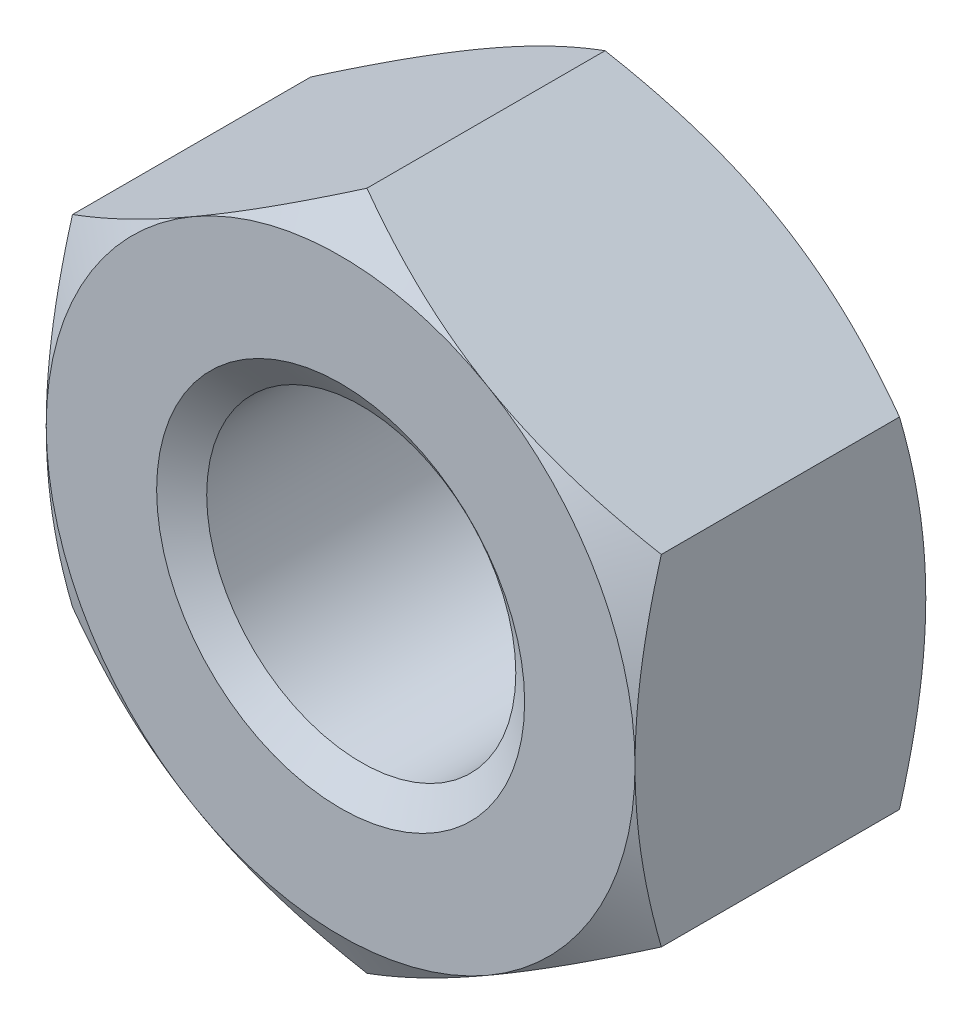
ISO-10303-21;
HEADER;
FILE_DESCRIPTION(('STEP AP214'),'2;1');
FILE_NAME('part.step','',(''),(''),'','','');
FILE_SCHEMA(('AUTOMOTIVE_DESIGN { 1 0 10303 214 1 1 1 1 }'));
ENDSEC;
DATA;
#1=APPLICATION_CONTEXT('core data for automotive mechanical design processes');
#2=APPLICATION_PROTOCOL_DEFINITION('international standard','automotive_design',2000,#1);
#3=PRODUCT_CONTEXT('',#1,'mechanical');
#4=PRODUCT('Part','Part','',(#3));
#5=PRODUCT_RELATED_PRODUCT_CATEGORY('part','',(#4));
#6=PRODUCT_DEFINITION_FORMATION('','',#4);
#7=PRODUCT_DEFINITION_CONTEXT('part definition',#1,'design');
#8=PRODUCT_DEFINITION('design','',#6,#7);
#9=PRODUCT_DEFINITION_SHAPE('','',#8);
#10=(LENGTH_UNIT() NAMED_UNIT(*) SI_UNIT(.MILLI.,.METRE.));
#11=(NAMED_UNIT(*) PLANE_ANGLE_UNIT() SI_UNIT($,.RADIAN.));
#12=(NAMED_UNIT(*) SI_UNIT($,.STERADIAN.) SOLID_ANGLE_UNIT());
#13=UNCERTAINTY_MEASURE_WITH_UNIT(LENGTH_MEASURE(1.E-05),#10,'distance_accuracy_value','');
#14=(GEOMETRIC_REPRESENTATION_CONTEXT(3) GLOBAL_UNCERTAINTY_ASSIGNED_CONTEXT((#13)) GLOBAL_UNIT_ASSIGNED_CONTEXT((#10,
#11,#12)) REPRESENTATION_CONTEXT('',''));
#15=CARTESIAN_POINT('',(0.,0.,0.));
#16=DIRECTION('',(0.,0.,1.));
#17=DIRECTION('',(1.,0.,0.));
#18=AXIS2_PLACEMENT_3D('',#15,#16,#17);
#19=CARTESIAN_POINT('',(0.,0.,-3.95));
#20=DIRECTION('',(0.,0.,1.));
#21=DIRECTION('',(1.,0.,0.));
#22=AXIS2_PLACEMENT_3D('',#19,#20,#21);
#23=CYLINDRICAL_SURFACE('',#22,2.1);
#24=CARTESIAN_POINT('',(0.,0.,-0.280083015283876));
#25=DIRECTION('',(0.,0.,1.));
#26=DIRECTION('',(1.,0.,0.));
#27=AXIS2_PLACEMENT_3D('',#24,#25,#26);
#28=CIRCLE('',#27,2.1);
#29=CARTESIAN_POINT('',(2.1,0.,-0.280083015283876));
#30=VERTEX_POINT('',#29);
#31=EDGE_CURVE('E174',#30,#30,#28,.F.);
#32=ORIENTED_EDGE('',*,*,#31,.F.);
#33=EDGE_LOOP('',(#32));
#34=FACE_BOUND('',#33,.T.);
#35=CARTESIAN_POINT('',(0.,0.,-3.64451698471612));
#36=DIRECTION('',(0.,0.,-1.));
#37=DIRECTION('',(-1.,0.,0.));
#38=AXIS2_PLACEMENT_3D('',#35,#36,#37);
#39=CIRCLE('',#38,2.1);
#40=CARTESIAN_POINT('',(-2.1,0.,-3.64451698471612));
#41=VERTEX_POINT('',#40);
#42=EDGE_CURVE('E39',#41,#41,#39,.F.);
#43=ORIENTED_EDGE('',*,*,#42,.F.);
#44=EDGE_LOOP('',(#43));
#45=FACE_BOUND('',#44,.T.);
#46=ADVANCED_FACE('F34',(#34,#45),#23,.F.);
#47=CARTESIAN_POINT('',(0.,4.61880215351703,-3.95));
#48=DIRECTION('',(0.,0.,-1.));
#49=DIRECTION('',(-1.,0.,0.));
#50=AXIS2_PLACEMENT_3D('',#47,#48,#49);
#51=PLANE('',#50);
#52=CARTESIAN_POINT('',(0.,0.,-3.95));
#53=DIRECTION('',(0.,0.,-1.));
#54=DIRECTION('',(-1.,0.,0.));
#55=AXIS2_PLACEMENT_3D('',#52,#53,#54);
#56=CIRCLE('',#55,4.);
#57=CARTESIAN_POINT('',(-4.,0.,-3.95));
#58=VERTEX_POINT('',#57);
#59=CARTESIAN_POINT('',(-2.00000000000003,-3.46410161513774,-3.95));
#60=VERTEX_POINT('',#59);
#61=EDGE_CURVE('E170',#58,#60,#56,.F.);
#62=ORIENTED_EDGE('',*,*,#61,.F.);
#63=CARTESIAN_POINT('',(-2.00000000000003,3.46410161513774,-3.95));
#64=VERTEX_POINT('',#63);
#65=EDGE_CURVE('E152',#64,#58,#56,.F.);
#66=ORIENTED_EDGE('',*,*,#65,.F.);
#67=CARTESIAN_POINT('',(2.00000000000004,3.46410161513773,-3.95));
#68=VERTEX_POINT('',#67);
#69=EDGE_CURVE('E169',#68,#64,#56,.F.);
#70=ORIENTED_EDGE('',*,*,#69,.F.);
#71=CARTESIAN_POINT('',(0.,0.,-3.95));
#72=DIRECTION('',(0.,0.,1.));
#73=DIRECTION('',(1.,0.,0.));
#74=AXIS2_PLACEMENT_3D('',#71,#72,#73);
#75=CIRCLE('',#74,4.);
#76=CARTESIAN_POINT('',(4.,0.,-3.95));
#77=VERTEX_POINT('',#76);
#78=EDGE_CURVE('E250',#77,#68,#75,.T.);
#79=ORIENTED_EDGE('',*,*,#78,.F.);
#80=CARTESIAN_POINT('',(2.00000000000003,-3.46410161513774,-3.95));
#81=VERTEX_POINT('',#80);
#82=EDGE_CURVE('E371',#81,#77,#56,.F.);
#83=ORIENTED_EDGE('',*,*,#82,.F.);
#84=EDGE_CURVE('E375',#60,#81,#56,.F.);
#85=ORIENTED_EDGE('',*,*,#84,.F.);
#86=EDGE_LOOP('',(#62,#66,#70,#79,#83,#85));
#87=FACE_BOUND('',#86,.T.);
#88=CARTESIAN_POINT('',(0.,0.,-3.95));
#89=DIRECTION('',(0.,0.,-1.));
#90=DIRECTION('',(-1.,0.,0.));
#91=AXIS2_PLACEMENT_3D('',#88,#89,#90);
#92=CIRCLE('',#91,2.5);
#93=CARTESIAN_POINT('',(-2.5,0.,-3.95));
#94=VERTEX_POINT('',#93);
#95=EDGE_CURVE('E177',#94,#94,#92,.F.);
#96=ORIENTED_EDGE('',*,*,#95,.T.);
#97=EDGE_LOOP('',(#96));
#98=FACE_BOUND('',#97,.T.);
#99=ADVANCED_FACE('F308',(#87,#98),#51,.T.);
#100=CARTESIAN_POINT('',(0.,4.61880215351703,0.));
#101=DIRECTION('',(0.,0.,-1.));
#102=DIRECTION('',(-1.,0.,0.));
#103=AXIS2_PLACEMENT_3D('',#100,#101,#102);
#104=PLANE('',#103);
#105=CARTESIAN_POINT('',(0.,0.,0.));
#106=DIRECTION('',(0.,0.,-1.));
#107=DIRECTION('',(-1.,0.,0.));
#108=AXIS2_PLACEMENT_3D('',#105,#106,#107);
#109=CIRCLE('',#108,4.);
#110=CARTESIAN_POINT('',(-4.,0.,0.));
#111=VERTEX_POINT('',#110);
#112=CARTESIAN_POINT('',(-2.00000000000003,3.46410161513774,0.));
#113=VERTEX_POINT('',#112);
#114=EDGE_CURVE('E11',#111,#113,#109,.T.);
#115=ORIENTED_EDGE('',*,*,#114,.F.);
#116=CARTESIAN_POINT('',(-2.00000000000003,-3.46410161513774,0.));
#117=VERTEX_POINT('',#116);
#118=EDGE_CURVE('E46',#117,#111,#109,.T.);
#119=ORIENTED_EDGE('',*,*,#118,.F.);
#120=CARTESIAN_POINT('',(2.00000000000003,-3.46410161513774,0.));
#121=VERTEX_POINT('',#120);
#122=EDGE_CURVE('E173',#121,#117,#109,.T.);
#123=ORIENTED_EDGE('',*,*,#122,.F.);
#124=CARTESIAN_POINT('',(4.,0.,0.));
#125=VERTEX_POINT('',#124);
#126=EDGE_CURVE('E362',#125,#121,#109,.T.);
#127=ORIENTED_EDGE('',*,*,#126,.F.);
#128=CARTESIAN_POINT('',(0.,0.,0.));
#129=DIRECTION('',(0.,0.,1.));
#130=DIRECTION('',(1.,0.,0.));
#131=AXIS2_PLACEMENT_3D('',#128,#129,#130);
#132=CIRCLE('',#131,4.);
#133=CARTESIAN_POINT('',(2.00000000000004,3.46410161513773,0.));
#134=VERTEX_POINT('',#133);
#135=EDGE_CURVE('E128',#125,#134,#132,.T.);
#136=ORIENTED_EDGE('',*,*,#135,.T.);
#137=EDGE_CURVE('E44',#113,#134,#109,.T.);
#138=ORIENTED_EDGE('',*,*,#137,.F.);
#139=EDGE_LOOP('',(#115,#119,#123,#127,#136,#138));
#140=FACE_BOUND('',#139,.T.);
#141=CARTESIAN_POINT('',(0.,0.,0.));
#142=DIRECTION('',(0.,0.,1.));
#143=DIRECTION('',(1.,0.,0.));
#144=AXIS2_PLACEMENT_3D('',#141,#142,#143);
#145=CIRCLE('',#144,2.5);
#146=CARTESIAN_POINT('',(2.5,0.,0.));
#147=VERTEX_POINT('',#146);
#148=EDGE_CURVE('E176',#147,#147,#145,.T.);
#149=ORIENTED_EDGE('',*,*,#148,.F.);
#150=EDGE_LOOP('',(#149));
#151=FACE_BOUND('',#150,.T.);
#152=ADVANCED_FACE('F255',(#140,#151),#104,.F.);
#153=CARTESIAN_POINT('',(0.,4.61880215351703,-3.95));
#154=DIRECTION('',(-0.500000000000007,0.866025403784434,0.));
#155=DIRECTION('',(-0.866025403784435,-0.500000000000007,0.));
#156=AXIS2_PLACEMENT_3D('',#153,#154,#155);
#157=PLANE('',#156);
#158=DIRECTION('',(0.,0.,1.));
#159=VECTOR('',#158,1.);
#160=CARTESIAN_POINT('',(-4.,2.30940107675848,-3.95));
#161=LINE('',#160,#159);
#162=CARTESIAN_POINT('',(-4.,2.30940107675855,-3.59273441009182));
#163=VERTEX_POINT('',#162);
#164=CARTESIAN_POINT('',(-4.,2.30940107675848,-0.357265589908163));
#165=VERTEX_POINT('',#164);
#166=EDGE_CURVE('E164',#163,#165,#161,.T.);
#167=ORIENTED_EDGE('',*,*,#166,.T.);
#168=CARTESIAN_POINT('',(-4.0002,2.30928560670464,-0.357332259074767));
#169=CARTESIAN_POINT('',(-3.82442084967677,2.41077174646168,-0.298717873648282));
#170=CARTESIAN_POINT('',(-3.64712438367362,2.51313390883498,-0.245410321462262));
#171=CARTESIAN_POINT('',(-3.2894614068243,2.7196307247981,-0.152361670746402));
#172=CARTESIAN_POINT('',(-3.10908854102985,2.82376904741903,-0.112653489029702));
#173=CARTESIAN_POINT('',(-2.75057818129721,3.03075510011794,-0.0508422152802767));
#174=CARTESIAN_POINT('',(-2.57249584706486,3.13357098372491,-0.0283277315228868));
#175=CARTESIAN_POINT('',(-2.2154932828335,3.33968651028528,-0.00145062314658061));
#176=CARTESIAN_POINT('',(-2.03657435035591,3.44298540411434,0.00293425857305748));
#177=CARTESIAN_POINT('',(-1.70225715780328,3.63600352522932,-0.00619007293997112));
#178=CARTESIAN_POINT('',(-1.54680884001294,3.72575165335065,-0.0174589539879962));
#179=CARTESIAN_POINT('',(-1.23692494436495,3.90466320392055,-0.0531739907981979));
#180=CARTESIAN_POINT('',(-1.08249043825587,3.99382600759479,-0.0776323457115395));
#181=CARTESIAN_POINT('',(-0.771967672225423,4.17310641015198,-0.138776064919299));
#182=CARTESIAN_POINT('',(-0.615918711936898,4.26320131938133,-0.175720603654875));
#183=CARTESIAN_POINT('',(-0.306148164596159,4.44204742827552,-0.259570072548043));
#184=CARTESIAN_POINT('',(-0.152422609226217,4.53080091904969,-0.306455302212758));
#185=CARTESIAN_POINT('',(0.000200000000004028,4.61891762357087,-0.357332259074788));
#186=B_SPLINE_CURVE_WITH_KNOTS('',3,(#168,#169,#170,#171,#172,#173,#174,#175,#176,#177,#178,
#179,#180,#181,#182,#183,#184,#185),.UNSPECIFIED.,.F.,.F.,(4,2,2,2,2,2,2,2,4),(0.,
0.634047835695967,1.26961969224544,1.88946157213122,2.50854226669297,3.04757825393387,
3.58711366126905,4.13861653143766,4.68903648037746),.UNSPECIFIED.);
#187=EDGE_CURVE('E133',#165,#113,#186,.T.);
#188=ORIENTED_EDGE('',*,*,#187,.T.);
#189=CARTESIAN_POINT('',(0.,4.61880215351703,-0.357265589908184));
#190=VERTEX_POINT('',#189);
#191=EDGE_CURVE('E53',#113,#190,#186,.T.);
#192=ORIENTED_EDGE('',*,*,#191,.T.);
#193=DIRECTION('',(0.,0.,1.));
#194=VECTOR('',#193,1.);
#195=CARTESIAN_POINT('',(0.,4.61880215351703,-3.95));
#196=LINE('',#195,#194);
#197=CARTESIAN_POINT('',(0.,4.61880215351703,-3.59273441009182));
#198=VERTEX_POINT('',#197);
#199=EDGE_CURVE('E149',#198,#190,#196,.T.);
#200=ORIENTED_EDGE('',*,*,#199,.F.);
#201=CARTESIAN_POINT('',(-4.0002,2.30928560670464,-3.59266774092524));
#202=CARTESIAN_POINT('',(-3.82442084967677,2.41077174646168,-3.65128212635172));
#203=CARTESIAN_POINT('',(-3.64712438367362,2.51313390883498,-3.70458967853774));
#204=CARTESIAN_POINT('',(-3.2894614068243,2.7196307247981,-3.7976383292536));
#205=CARTESIAN_POINT('',(-3.10908854102985,2.82376904741903,-3.8373465109703));
#206=CARTESIAN_POINT('',(-2.75057818129722,3.03075510011794,-3.89915778471972));
#207=CARTESIAN_POINT('',(-2.57249584706487,3.13357098372491,-3.92167226847711));
#208=CARTESIAN_POINT('',(-2.2154932828335,3.33968651028527,-3.94854937685342));
#209=CARTESIAN_POINT('',(-2.03657435035591,3.44298540411433,-3.95293425857306));
#210=CARTESIAN_POINT('',(-1.70225715780328,3.63600352522932,-3.94380992706003));
#211=CARTESIAN_POINT('',(-1.54680884001294,3.72575165335065,-3.932541046012));
#212=CARTESIAN_POINT('',(-1.23692494436495,3.90466320392055,-3.8968260092018));
#213=CARTESIAN_POINT('',(-1.08249043825587,3.99382600759479,-3.87236765428846));
#214=CARTESIAN_POINT('',(-0.771967672225424,4.17310641015198,-3.8112239350807));
#215=CARTESIAN_POINT('',(-0.615918711936899,4.26320131938133,-3.77427939634513));
#216=CARTESIAN_POINT('',(-0.306148164596159,4.44204742827552,-3.69042992745196));
#217=CARTESIAN_POINT('',(-0.152422609226218,4.53080091904968,-3.64354469778725));
#218=CARTESIAN_POINT('',(0.000200000000004024,4.61891762357087,-3.59266774092522));
#219=B_SPLINE_CURVE_WITH_KNOTS('',3,(#201,#202,#203,#204,#205,#206,#207,#208,#209,#210,#211,
#212,#213,#214,#215,#216,#217,#218),.UNSPECIFIED.,.F.,.F.,(4,2,2,2,2,2,2,2,4),(0.,
0.634047835695966,1.26961969224543,1.88946157213122,2.50854226669297,3.04757825393386,
3.58711366126905,4.13861653143766,4.68903648037746),.UNSPECIFIED.);
#220=EDGE_CURVE('E167',#64,#198,#219,.T.);
#221=ORIENTED_EDGE('',*,*,#220,.F.);
#222=EDGE_CURVE('E266',#163,#64,#219,.T.);
#223=ORIENTED_EDGE('',*,*,#222,.F.);
#224=EDGE_LOOP('',(#167,#188,#192,#200,#221,#223));
#225=FACE_BOUND('',#224,.T.);
#226=ADVANCED_FACE('F36',(#225),#157,.T.);
#227=CARTESIAN_POINT('',(4.,2.30940107675847,-3.95));
#228=DIRECTION('',(0.500000000000009,0.866025403784433,0.));
#229=DIRECTION('',(-0.866025403784433,0.500000000000009,0.));
#230=AXIS2_PLACEMENT_3D('',#227,#228,#229);
#231=PLANE('',#230);
#232=ORIENTED_EDGE('',*,*,#199,.T.);
#233=CARTESIAN_POINT('',(-0.000199999999996007,4.61891762357087,-0.357332259074788));
#234=CARTESIAN_POINT('',(0.175579150323232,4.51743148381383,-0.298717873648301));
#235=CARTESIAN_POINT('',(0.352875616326385,4.41506932144053,-0.245410321462279));
#236=CARTESIAN_POINT('',(0.710538593175711,4.20857250547741,-0.152361670746414));
#237=CARTESIAN_POINT('',(0.890911458970156,4.10443418285648,-0.112653489029713));
#238=CARTESIAN_POINT('',(1.2494218187028,3.89744813015756,-0.0508422152802838));
#239=CARTESIAN_POINT('',(1.42750415293515,3.7946322465506,-0.0283277315228919));
#240=CARTESIAN_POINT('',(1.78450671716651,3.58851671999023,-0.0014506231465821));
#241=CARTESIAN_POINT('',(1.96342564964411,3.48521782616117,0.00293425857305754));
#242=CARTESIAN_POINT('',(2.29774284219674,3.29219970504618,-0.00619007293996784));
#243=CARTESIAN_POINT('',(2.45319115998707,3.20245157692485,-0.0174589539879911));
#244=CARTESIAN_POINT('',(2.76307505563506,3.02354002635495,-0.0531739907981892));
#245=CARTESIAN_POINT('',(2.91750956174413,2.93437722268071,-0.0776323457115289));
#246=CARTESIAN_POINT('',(3.22803232777458,2.75509682012352,-0.138776064919285));
#247=CARTESIAN_POINT('',(3.3840812880631,2.66500191089418,-0.175720603654859));
#248=CARTESIAN_POINT('',(3.69385183540384,2.48615580199998,-0.259570072548024));
#249=CARTESIAN_POINT('',(3.84757739077378,2.39740231122582,-0.306455302212737));
#250=CARTESIAN_POINT('',(4.0002,2.30928560670464,-0.357332259074765));
#251=B_SPLINE_CURVE_WITH_KNOTS('',3,(#233,#234,#235,#236,#237,#238,#239,#240,#241,#242,#243,
#244,#245,#246,#247,#248,#249,#250),.UNSPECIFIED.,.F.,.F.,(4,2,2,2,2,2,2,2,4),(0.,
0.634047835695972,1.26961969224545,1.88946157213124,2.50854226669299,3.04757825393388,
3.58711366126906,4.13861653143766,4.68903648037746),.UNSPECIFIED.);
#252=EDGE_CURVE('E143',#190,#134,#251,.T.);
#253=ORIENTED_EDGE('',*,*,#252,.T.);
#254=CARTESIAN_POINT('',(4.,2.30940107675855,-0.357265589908184));
#255=VERTEX_POINT('',#254);
#256=EDGE_CURVE('E60',#134,#255,#251,.T.);
#257=ORIENTED_EDGE('',*,*,#256,.T.);
#258=DIRECTION('',(0.,0.,1.));
#259=VECTOR('',#258,1.);
#260=CARTESIAN_POINT('',(4.,2.30940107675847,-3.95));
#261=LINE('',#260,#259);
#262=CARTESIAN_POINT('',(4.,2.30940107675855,-3.59273441009182));
#263=VERTEX_POINT('',#262);
#264=EDGE_CURVE('E142',#263,#255,#261,.T.);
#265=ORIENTED_EDGE('',*,*,#264,.F.);
#266=CARTESIAN_POINT('',(-0.000199999999996007,4.61891762357087,-3.59266774092522));
#267=CARTESIAN_POINT('',(0.175579150323232,4.51743148381383,-3.6512821263517));
#268=CARTESIAN_POINT('',(0.352875616326384,4.41506932144053,-3.70458967853773));
#269=CARTESIAN_POINT('',(0.71053859317571,4.20857250547741,-3.79763832925359));
#270=CARTESIAN_POINT('',(0.890911458970154,4.10443418285648,-3.83734651097029));
#271=CARTESIAN_POINT('',(1.24942181870279,3.89744813015757,-3.89915778471972));
#272=CARTESIAN_POINT('',(1.42750415293514,3.7946322465506,-3.92167226847711));
#273=CARTESIAN_POINT('',(1.78450671716651,3.58851671999023,-3.94854937685342));
#274=CARTESIAN_POINT('',(1.9634256496441,3.48521782616117,-3.95293425857306));
#275=CARTESIAN_POINT('',(2.29774284219673,3.29219970504618,-3.94380992706003));
#276=CARTESIAN_POINT('',(2.45319115998707,3.20245157692485,-3.93254104601201));
#277=CARTESIAN_POINT('',(2.76307505563506,3.02354002635495,-3.89682600920181));
#278=CARTESIAN_POINT('',(2.91750956174413,2.93437722268071,-3.87236765428847));
#279=CARTESIAN_POINT('',(3.22803232777458,2.75509682012352,-3.81122393508072));
#280=CARTESIAN_POINT('',(3.3840812880631,2.66500191089418,-3.77427939634514));
#281=CARTESIAN_POINT('',(3.69385183540384,2.48615580199998,-3.69042992745198));
#282=CARTESIAN_POINT('',(3.84757739077378,2.39740231122582,-3.64354469778727));
#283=CARTESIAN_POINT('',(4.0002,2.30928560670464,-3.59266774092524));
#284=B_SPLINE_CURVE_WITH_KNOTS('',3,(#266,#267,#268,#269,#270,#271,#272,#273,#274,#275,#276,
#277,#278,#279,#280,#281,#282,#283),.UNSPECIFIED.,.F.,.F.,(4,2,2,2,2,2,2,2,4),(0.,
0.634047835695971,1.26961969224544,1.88946157213123,2.50854226669299,3.04757825393387,
3.58711366126905,4.13861653143766,4.68903648037746),.UNSPECIFIED.);
#285=EDGE_CURVE('E259',#68,#263,#284,.T.);
#286=ORIENTED_EDGE('',*,*,#285,.F.);
#287=EDGE_CURVE('E265',#198,#68,#284,.T.);
#288=ORIENTED_EDGE('',*,*,#287,.F.);
#289=EDGE_LOOP('',(#232,#253,#257,#265,#286,#288));
#290=FACE_BOUND('',#289,.T.);
#291=ADVANCED_FACE('F140',(#290),#231,.T.);
#292=CARTESIAN_POINT('',(4.,2.30940107675847,-3.95));
#293=DIRECTION('',(-1.,0.,0.));
#294=DIRECTION('',(0.,0.,1.));
#295=AXIS2_PLACEMENT_3D('',#292,#293,#294);
#296=PLANE('',#295);
#297=CARTESIAN_POINT('',(4.,-6.12487198995898,-1.9141068212407));
#298=CARTESIAN_POINT('',(4.,-5.94924937038682,-1.82923627076695));
#299=CARTESIAN_POINT('',(4.,-5.77321152095291,-1.74520940380745));
#300=CARTESIAN_POINT('',(4.,-5.4200808477796,-1.57932514679721));
#301=CARTESIAN_POINT('',(4.,-5.24298784779933,-1.49746813236728));
#302=CARTESIAN_POINT('',(4.,-4.88656571686339,-1.3359744630586));
#303=CARTESIAN_POINT('',(4.,-4.70722958889368,-1.25635319506308));
#304=CARTESIAN_POINT('',(4.,-4.34708334747269,-1.10053058542034));
#305=CARTESIAN_POINT('',(4.,-4.16627331143543,-1.02432906550806));
#306=CARTESIAN_POINT('',(4.,-3.80064706744983,-0.875350650394396));
#307=CARTESIAN_POINT('',(4.,-3.61580892822775,-0.802627284215878));
#308=CARTESIAN_POINT('',(4.,-3.24395246794974,-0.662876230959448));
#309=CARTESIAN_POINT('',(4.,-3.05693390695806,-0.595849177566531));
#310=CARTESIAN_POINT('',(4.,-2.68080318253775,-0.469291748430904));
#311=CARTESIAN_POINT('',(4.,-2.49169643712853,-0.409745434783858));
#312=CARTESIAN_POINT('',(4.,-2.11079454635856,-0.300083356544523));
#313=CARTESIAN_POINT('',(4.,-1.91900027185753,-0.249964609676767));
#314=CARTESIAN_POINT('',(4.,-1.53259232698204,-0.161590794954053));
#315=CARTESIAN_POINT('',(4.,-1.33797792031654,-0.123338885956549));
#316=CARTESIAN_POINT('',(4.,-0.946402725872593,-0.0612742359223493));
#317=CARTESIAN_POINT('',(4.,-0.749441936019812,-0.0374615076517035));
#318=CARTESIAN_POINT('',(4.,-0.355451989627978,-0.00638181314943817));
#319=CARTESIAN_POINT('',(4.,-0.158431311094046,0.000989900761040821));
#320=CARTESIAN_POINT('',(4.,0.235472085607436,-0.00120406637479435));
#321=CARTESIAN_POINT('',(4.,0.432354826312174,-0.0107653508153491));
#322=CARTESIAN_POINT('',(4.,0.768560635225483,-0.0408787346135881));
#323=CARTESIAN_POINT('',(4.,0.908254618381783,-0.0575092960439064));
#324=CARTESIAN_POINT('',(4.,1.18656349063493,-0.0982134103466865));
#325=CARTESIAN_POINT('',(4.,1.32517820601008,-0.12228813705844));
#326=CARTESIAN_POINT('',(4.,1.73929045452963,-0.204415070950221));
#327=CARTESIAN_POINT('',(4.,2.01284690528716,-0.272348886425141));
#328=CARTESIAN_POINT('',(4.,2.42218253014516,-0.389516359317188));
#329=CARTESIAN_POINT('',(4.,2.56009536361531,-0.431713941811619));
#330=CARTESIAN_POINT('',(4.,2.83448159101395,-0.520284580227743));
#331=CARTESIAN_POINT('',(4.,2.97095590623549,-0.566654756186892));
#332=CARTESIAN_POINT('',(4.,3.24189440516332,-0.662605699180263));
#333=CARTESIAN_POINT('',(4.,3.37636557946829,-0.712166925753476));
#334=CARTESIAN_POINT('',(4.,3.64426461152904,-0.814198353790675));
#335=CARTESIAN_POINT('',(4.,3.77769202239377,-0.866669730963341));
#336=CARTESIAN_POINT('',(4.,3.91063698986673,-0.920309006541764));
#337=B_SPLINE_CURVE_WITH_KNOTS('',3,(#297,#298,#299,#300,#301,#302,#303,#304,#305,#306,#307,
#308,#309,#310,#311,#312,#313,#314,#315,#316,#317,#318,#319,#320,#321,#322,#323,#324,#325,#326,
#327,#328,#329,#330,#331,#332,#333,#334,#335,#336),.UNSPECIFIED.,.F.,.F.,(4,2,2,2,2,2,2,2,2,2,2,
2,2,2,2,2,2,2,2,4),(0.,0.585171792532273,1.17044423059927,1.7590659464599,2.34765694284828,
2.94347400997485,3.53935727210691,4.13394864697603,4.72835161391474,5.32291267067848,
5.91747425310816,6.5082368585404,7.09884609659891,7.52068140825525,7.94258327130842,
8.78701491359829,9.21965281897688,9.65199437116295,10.0819024146297,10.5119854255246),.UNSPECIFIED.);
#338=CARTESIAN_POINT('',(4.,-2.30940107675855,-0.357265589908184));
#339=VERTEX_POINT('',#338);
#340=EDGE_CURVE('E135',#339,#125,#337,.T.);
#341=ORIENTED_EDGE('',*,*,#340,.F.);
#342=DIRECTION('',(0.,0.,1.));
#343=VECTOR('',#342,1.);
#344=CARTESIAN_POINT('',(4.,-2.30940107675855,-3.95));
#345=LINE('',#344,#343);
#346=CARTESIAN_POINT('',(4.,-2.30940107675855,-3.59273441009182));
#347=VERTEX_POINT('',#346);
#348=EDGE_CURVE('E150',#347,#339,#345,.T.);
#349=ORIENTED_EDGE('',*,*,#348,.F.);
#350=CARTESIAN_POINT('',(4.,-6.12487198995897,-2.03589317875933));
#351=CARTESIAN_POINT('',(4.,-5.94924937038682,-2.12076372923307));
#352=CARTESIAN_POINT('',(4.,-5.77321152095291,-2.20479059619258));
#353=CARTESIAN_POINT('',(4.,-5.4200808477796,-2.37067485320281));
#354=CARTESIAN_POINT('',(4.,-5.24298784779933,-2.45253186763274));
#355=CARTESIAN_POINT('',(4.,-4.88656571686339,-2.61402553694142));
#356=CARTESIAN_POINT('',(4.,-4.70722958889367,-2.69364680493694));
#357=CARTESIAN_POINT('',(4.,-4.34708334747268,-2.84946941457968));
#358=CARTESIAN_POINT('',(4.,-4.16627331143543,-2.92567093449196));
#359=CARTESIAN_POINT('',(4.,-3.80064706744982,-3.07464934960562));
#360=CARTESIAN_POINT('',(4.,-3.61580892822775,-3.14737271578414));
#361=CARTESIAN_POINT('',(4.,-3.24395246794973,-3.28712376904056));
#362=CARTESIAN_POINT('',(4.,-3.05693390695806,-3.35415082243348));
#363=CARTESIAN_POINT('',(4.,-2.68080318253775,-3.4807082515691));
#364=CARTESIAN_POINT('',(4.,-2.49169643712853,-3.54025456521615));
#365=CARTESIAN_POINT('',(4.,-2.11079454635856,-3.64991664345548));
#366=CARTESIAN_POINT('',(4.,-1.91900027185753,-3.70003539032324));
#367=CARTESIAN_POINT('',(4.,-1.53259232698204,-3.78840920504595));
#368=CARTESIAN_POINT('',(4.,-1.33797792031654,-3.82666111404345));
#369=CARTESIAN_POINT('',(4.,-0.946402725872595,-3.88872576407765));
#370=CARTESIAN_POINT('',(4.,-0.749441936019814,-3.9125384923483));
#371=CARTESIAN_POINT('',(4.,-0.355451989627982,-3.94361818685056));
#372=CARTESIAN_POINT('',(4.,-0.15843131109405,-3.95098990076104));
#373=CARTESIAN_POINT('',(4.,0.235472085607432,-3.94879593362521));
#374=CARTESIAN_POINT('',(4.,0.432354826312169,-3.93923464918465));
#375=CARTESIAN_POINT('',(4.,0.76856063522548,-3.90912126538641));
#376=CARTESIAN_POINT('',(4.,0.908254618381782,-3.8924907039561));
#377=CARTESIAN_POINT('',(4.,1.18656349063493,-3.85178658965331));
#378=CARTESIAN_POINT('',(4.,1.32517820601009,-3.82771186294156));
#379=CARTESIAN_POINT('',(4.,1.73929045452965,-3.74558492904978));
#380=CARTESIAN_POINT('',(4.,2.01284690528718,-3.67765111357486));
#381=CARTESIAN_POINT('',(4.,2.42218253014519,-3.56048364068281));
#382=CARTESIAN_POINT('',(4.,2.56009536361534,-3.51828605818838));
#383=CARTESIAN_POINT('',(4.,2.83448159101399,-3.42971541977225));
#384=CARTESIAN_POINT('',(4.,2.97095590623552,-3.38334524381311));
#385=CARTESIAN_POINT('',(4.,3.24189440516335,-3.28739430081973));
#386=CARTESIAN_POINT('',(4.,3.37636557946833,-3.23783307424652));
#387=CARTESIAN_POINT('',(4.,3.64426461152908,-3.13580164620932));
#388=CARTESIAN_POINT('',(4.,3.77769202239381,-3.08333026903665));
#389=CARTESIAN_POINT('',(4.,3.91063698986678,-3.02969099345823));
#390=B_SPLINE_CURVE_WITH_KNOTS('',3,(#350,#351,#352,#353,#354,#355,#356,#357,#358,#359,#360,
#361,#362,#363,#364,#365,#366,#367,#368,#369,#370,#371,#372,#373,#374,#375,#376,#377,#378,#379,
#380,#381,#382,#383,#384,#385,#386,#387,#388,#389),.UNSPECIFIED.,.F.,.F.,(4,2,2,2,2,2,2,2,2,2,2,
2,2,2,2,2,2,2,2,4),(0.,0.585171792532273,1.17044423059927,1.7590659464599,2.34765694284827,
2.94347400997484,3.5393572721069,4.13394864697602,4.72835161391473,5.32291267067847,
5.91747425310815,6.50823685854039,7.09884609659889,7.52068140825523,7.94258327130841,
8.78701491359831,9.2196528189769,9.65199437116298,10.0819024146297,10.5119854255247),.UNSPECIFIED.);
#391=EDGE_CURVE('E273',#347,#77,#390,.T.);
#392=ORIENTED_EDGE('',*,*,#391,.T.);
#393=EDGE_CURVE('E148',#77,#263,#390,.T.);
#394=ORIENTED_EDGE('',*,*,#393,.T.);
#395=ORIENTED_EDGE('',*,*,#264,.T.);
#396=EDGE_CURVE('E125',#125,#255,#337,.T.);
#397=ORIENTED_EDGE('',*,*,#396,.F.);
#398=EDGE_LOOP('',(#341,#349,#392,#394,#395,#397));
#399=FACE_BOUND('',#398,.T.);
#400=ADVANCED_FACE('F146',(#399),#296,.F.);
#401=CARTESIAN_POINT('',(0.,-4.6188021535171,-3.95));
#402=DIRECTION('',(0.500000000000006,-0.866025403784435,0.));
#403=DIRECTION('',(0.866025403784435,0.500000000000006,0.));
#404=AXIS2_PLACEMENT_3D('',#401,#402,#403);
#405=PLANE('',#404);
#406=ORIENTED_EDGE('',*,*,#348,.T.);
#407=CARTESIAN_POINT('',(4.0002,-2.30928560670472,-0.357332259074788));
#408=CARTESIAN_POINT('',(3.82442084967677,-2.41077174646176,-0.298717873648304));
#409=CARTESIAN_POINT('',(3.64712438367362,-2.51313390883505,-0.245410321462285));
#410=CARTESIAN_POINT('',(3.28946140682429,-2.71963072479818,-0.152361670746426));
#411=CARTESIAN_POINT('',(3.10908854102984,-2.8237690474191,-0.112653489029728));
#412=CARTESIAN_POINT('',(2.7505781812972,-3.03075510011802,-0.0508422152803052));
#413=CARTESIAN_POINT('',(2.57249584706485,-3.13357098372499,-0.0283277315229169));
#414=CARTESIAN_POINT('',(2.21549328283348,-3.33968651028536,-0.00145062314661366));
#415=CARTESIAN_POINT('',(2.03657435035589,-3.44298540411442,0.00293425857302299));
#416=CARTESIAN_POINT('',(1.70225715780326,-3.6360035252294,-0.00619007294000858));
#417=CARTESIAN_POINT('',(1.54680884001292,-3.72575165335073,-0.0174589539880349));
#418=CARTESIAN_POINT('',(1.23692494436494,-3.90466320392062,-0.0531739907982379));
#419=CARTESIAN_POINT('',(1.08249043825586,-3.99382600759487,-0.0776323457115795));
#420=CARTESIAN_POINT('',(0.771967672225415,-4.17310641015206,-0.138776064919339));
#421=CARTESIAN_POINT('',(0.615918711936892,-4.2632013193814,-0.175720603654915));
#422=CARTESIAN_POINT('',(0.306148164596157,-4.44204742827559,-0.259570072548083));
#423=CARTESIAN_POINT('',(0.152422609226218,-4.53080091904975,-0.306455302212797));
#424=CARTESIAN_POINT('',(-0.000200000000001571,-4.61891762357094,-0.357332259074826));
#425=B_SPLINE_CURVE_WITH_KNOTS('',3,(#407,#408,#409,#410,#411,#412,#413,#414,#415,#416,#417,
#418,#419,#420,#421,#422,#423,#424),.UNSPECIFIED.,.F.,.F.,(4,2,2,2,2,2,2,2,4),(0.,
0.634047835695972,1.26961969224545,1.88946157213124,2.50854226669299,3.04757825393388,
3.58711366126906,4.13861653143766,4.68903648037745),.UNSPECIFIED.);
#426=EDGE_CURVE('E357',#339,#121,#425,.T.);
#427=ORIENTED_EDGE('',*,*,#426,.T.);
#428=CARTESIAN_POINT('',(-1.15792792021452E-13,-4.61880215351703,-0.357265589908184));
#429=VERTEX_POINT('',#428);
#430=EDGE_CURVE('E227',#121,#429,#425,.T.);
#431=ORIENTED_EDGE('',*,*,#430,.T.);
#432=DIRECTION('',(0.,0.,1.));
#433=VECTOR('',#432,1.);
#434=CARTESIAN_POINT('',(0.,-4.6188021535171,-3.95));
#435=LINE('',#434,#433);
#436=CARTESIAN_POINT('',(-1.15792792021452E-13,-4.61880215351703,-3.59273441009182));
#437=VERTEX_POINT('',#436);
#438=EDGE_CURVE('E155',#437,#429,#435,.T.);
#439=ORIENTED_EDGE('',*,*,#438,.F.);
#440=CARTESIAN_POINT('',(4.0002,-2.30928560670472,-3.59266774092522));
#441=CARTESIAN_POINT('',(3.82442084967677,-2.41077174646176,-3.6512821263517));
#442=CARTESIAN_POINT('',(3.64712438367362,-2.51313390883505,-3.70458967853772));
#443=CARTESIAN_POINT('',(3.28946140682429,-2.71963072479817,-3.79763832925358));
#444=CARTESIAN_POINT('',(3.10908854102985,-2.8237690474191,-3.83734651097027));
#445=CARTESIAN_POINT('',(2.75057818129721,-3.03075510011802,-3.8991577847197));
#446=CARTESIAN_POINT('',(2.57249584706485,-3.13357098372498,-3.92167226847708));
#447=CARTESIAN_POINT('',(2.21549328283348,-3.33968651028535,-3.94854937685339));
#448=CARTESIAN_POINT('',(2.03657435035589,-3.44298540411441,-3.95293425857302));
#449=CARTESIAN_POINT('',(1.70225715780326,-3.6360035252294,-3.94380992705999));
#450=CARTESIAN_POINT('',(1.54680884001293,-3.72575165335072,-3.93254104601197));
#451=CARTESIAN_POINT('',(1.23692494436494,-3.90466320392062,-3.89682600920176));
#452=CARTESIAN_POINT('',(1.08249043825586,-3.99382600759487,-3.87236765428842));
#453=CARTESIAN_POINT('',(0.771967672225418,-4.17310641015206,-3.81122393508066));
#454=CARTESIAN_POINT('',(0.615918711936894,-4.2632013193814,-3.77427939634509));
#455=CARTESIAN_POINT('',(0.306148164596158,-4.44204742827559,-3.69042992745192));
#456=CARTESIAN_POINT('',(0.152422609226219,-4.53080091904975,-3.64354469778721));
#457=CARTESIAN_POINT('',(-0.000200000000001327,-4.61891762357094,-3.59266774092518));
#458=B_SPLINE_CURVE_WITH_KNOTS('',3,(#440,#441,#442,#443,#444,#445,#446,#447,#448,#449,#450,
#451,#452,#453,#454,#455,#456,#457),.UNSPECIFIED.,.F.,.F.,(4,2,2,2,2,2,2,2,4),(0.,
0.63404783569597,1.26961969224544,1.88946157213123,2.50854226669299,3.04757825393387,
3.58711366126905,4.13861653143766,4.68903648037745),.UNSPECIFIED.);
#459=EDGE_CURVE('E280',#81,#437,#458,.T.);
#460=ORIENTED_EDGE('',*,*,#459,.F.);
#461=EDGE_CURVE('E279',#347,#81,#458,.T.);
#462=ORIENTED_EDGE('',*,*,#461,.F.);
#463=EDGE_LOOP('',(#406,#427,#431,#439,#460,#462));
#464=FACE_BOUND('',#463,.T.);
#465=ADVANCED_FACE('F292',(#464),#405,.T.);
#466=CARTESIAN_POINT('',(-4.,-2.30940107675855,-3.95));
#467=DIRECTION('',(-0.500000000000008,-0.866025403784434,0.));
#468=DIRECTION('',(0.866025403784434,-0.500000000000007,0.));
#469=AXIS2_PLACEMENT_3D('',#466,#467,#468);
#470=PLANE('',#469);
#471=ORIENTED_EDGE('',*,*,#438,.T.);
#472=CARTESIAN_POINT('',(0.000199999999998498,-4.61891762357094,-0.357332259074826));
#473=CARTESIAN_POINT('',(-0.175579150323232,-4.51743148381389,-0.298717873648339));
#474=CARTESIAN_POINT('',(-0.352875616326388,-4.4150693214406,-0.245410321462316));
#475=CARTESIAN_POINT('',(-0.710538593175719,-4.20857250547747,-0.152361670746451));
#476=CARTESIAN_POINT('',(-0.890911458970167,-4.10443418285654,-0.112653489029748));
#477=CARTESIAN_POINT('',(-1.24942181870281,-3.89744813015762,-0.0508422152803186));
#478=CARTESIAN_POINT('',(-1.42750415293517,-3.79463224655065,-0.0283277315229266));
#479=CARTESIAN_POINT('',(-1.78450671716654,-3.58851671999028,-0.00145062314661673));
#480=CARTESIAN_POINT('',(-1.96342564964413,-3.48521782616122,0.0029342585730229));
#481=CARTESIAN_POINT('',(-2.29774284219677,-3.29219970504623,-0.00619007294000264));
#482=CARTESIAN_POINT('',(-2.4531911599871,-3.20245157692491,-0.0174589539880255));
#483=CARTESIAN_POINT('',(-2.76307505563508,-3.02354002635501,-0.0531739907982225));
#484=CARTESIAN_POINT('',(-2.91750956174415,-2.93437722268077,-0.0776323457115615));
#485=CARTESIAN_POINT('',(-3.22803232777459,-2.75509682012358,-0.138776064919315));
#486=CARTESIAN_POINT('',(-3.38408128806311,-2.66500191089424,-0.175720603654888));
#487=CARTESIAN_POINT('',(-3.69385183540385,-2.48615580200005,-0.259570072548049));
#488=CARTESIAN_POINT('',(-3.84757739077378,-2.39740231122589,-0.306455302212761));
#489=CARTESIAN_POINT('',(-4.0002,-2.30928560670471,-0.357332259074787));
#490=B_SPLINE_CURVE_WITH_KNOTS('',3,(#472,#473,#474,#475,#476,#477,#478,#479,#480,#481,#482,
#483,#484,#485,#486,#487,#488,#489),.UNSPECIFIED.,.F.,.F.,(4,2,2,2,2,2,2,2,4),(0.,
0.634047835695981,1.26961969224546,1.88946157213126,2.50854226669303,3.04757825393391,
3.58711366126907,4.13861653143767,4.68903648037746),.UNSPECIFIED.);
#491=EDGE_CURVE('E355',#429,#117,#490,.T.);
#492=ORIENTED_EDGE('',*,*,#491,.T.);
#493=CARTESIAN_POINT('',(-4.,-2.30940107675855,-0.357265589908184));
#494=VERTEX_POINT('',#493);
#495=EDGE_CURVE('E200',#117,#494,#490,.T.);
#496=ORIENTED_EDGE('',*,*,#495,.T.);
#497=DIRECTION('',(0.,0.,1.));
#498=VECTOR('',#497,1.);
#499=CARTESIAN_POINT('',(-4.,-2.30940107675855,-3.95));
#500=LINE('',#499,#498);
#501=CARTESIAN_POINT('',(-4.,-2.30940107675855,-3.59273441009182));
#502=VERTEX_POINT('',#501);
#503=EDGE_CURVE('E161',#502,#494,#500,.T.);
#504=ORIENTED_EDGE('',*,*,#503,.F.);
#505=CARTESIAN_POINT('',(0.00019999999999844,-4.61891762357094,-3.59266774092518));
#506=CARTESIAN_POINT('',(-0.175579150323232,-4.51743148381389,-3.65128212635167));
#507=CARTESIAN_POINT('',(-0.352875616326387,-4.4150693214406,-3.70458967853769));
#508=CARTESIAN_POINT('',(-0.710538593175718,-4.20857250547747,-3.79763832925355));
#509=CARTESIAN_POINT('',(-0.890911458970166,-4.10443418285654,-3.83734651097025));
#510=CARTESIAN_POINT('',(-1.24942181870281,-3.89744813015762,-3.89915778471968));
#511=CARTESIAN_POINT('',(-1.42750415293516,-3.79463224655066,-3.92167226847707));
#512=CARTESIAN_POINT('',(-1.78450671716654,-3.58851671999028,-3.94854937685338));
#513=CARTESIAN_POINT('',(-1.96342564964413,-3.48521782616122,-3.95293425857302));
#514=CARTESIAN_POINT('',(-2.29774284219676,-3.29219970504623,-3.94380992706));
#515=CARTESIAN_POINT('',(-2.45319115998709,-3.20245157692491,-3.93254104601198));
#516=CARTESIAN_POINT('',(-2.76307505563508,-3.02354002635501,-3.89682600920178));
#517=CARTESIAN_POINT('',(-2.91750956174415,-2.93437722268077,-3.87236765428844));
#518=CARTESIAN_POINT('',(-3.22803232777459,-2.75509682012359,-3.81122393508069));
#519=CARTESIAN_POINT('',(-3.38408128806311,-2.66500191089425,-3.77427939634512));
#520=CARTESIAN_POINT('',(-3.69385183540384,-2.48615580200005,-3.69042992745196));
#521=CARTESIAN_POINT('',(-3.84757739077378,-2.39740231122589,-3.64354469778724));
#522=CARTESIAN_POINT('',(-4.0002,-2.30928560670471,-3.59266774092522));
#523=B_SPLINE_CURVE_WITH_KNOTS('',3,(#505,#506,#507,#508,#509,#510,#511,#512,#513,#514,#515,
#516,#517,#518,#519,#520,#521,#522),.UNSPECIFIED.,.F.,.F.,(4,2,2,2,2,2,2,2,4),(0.,
0.634047835695979,1.26961969224546,1.88946157213126,2.50854226669302,3.0475782539339,
3.58711366126907,4.13861653143767,4.68903648037745),.UNSPECIFIED.);
#524=EDGE_CURVE('E287',#60,#502,#523,.T.);
#525=ORIENTED_EDGE('',*,*,#524,.F.);
#526=EDGE_CURVE('E286',#437,#60,#523,.T.);
#527=ORIENTED_EDGE('',*,*,#526,.F.);
#528=EDGE_LOOP('',(#471,#492,#496,#504,#525,#527));
#529=FACE_BOUND('',#528,.T.);
#530=ADVANCED_FACE('F295',(#529),#470,.T.);
#531=CARTESIAN_POINT('',(-4.,2.30940107675848,-3.95));
#532=DIRECTION('',(-1.,0.,0.));
#533=DIRECTION('',(0.,0.,1.));
#534=AXIS2_PLACEMENT_3D('',#531,#532,#533);
#535=PLANE('',#534);
#536=ORIENTED_EDGE('',*,*,#503,.T.);
#537=CARTESIAN_POINT('',(-4.,-6.12487198995897,-1.91410682124069));
#538=CARTESIAN_POINT('',(-4.,-5.94924937038681,-1.82923627076695));
#539=CARTESIAN_POINT('',(-4.,-5.77321152095291,-1.74520940380745));
#540=CARTESIAN_POINT('',(-4.,-5.42008084777959,-1.57932514679721));
#541=CARTESIAN_POINT('',(-4.,-5.24298784779932,-1.49746813236728));
#542=CARTESIAN_POINT('',(-4.,-4.88656571686339,-1.3359744630586));
#543=CARTESIAN_POINT('',(-4.,-4.70722958889367,-1.25635319506308));
#544=CARTESIAN_POINT('',(-4.,-4.34708334747268,-1.10053058542033));
#545=CARTESIAN_POINT('',(-4.,-4.16627331143542,-1.02432906550806));
#546=CARTESIAN_POINT('',(-4.,-3.80064706744982,-0.875350650394393));
#547=CARTESIAN_POINT('',(-4.,-3.61580892822774,-0.802627284215875));
#548=CARTESIAN_POINT('',(-4.,-3.24395246794973,-0.662876230959446));
#549=CARTESIAN_POINT('',(-4.,-3.05693390695805,-0.595849177566528));
#550=CARTESIAN_POINT('',(-4.,-2.68080318253775,-0.469291748430902));
#551=CARTESIAN_POINT('',(-4.,-2.49169643712853,-0.409745434783856));
#552=CARTESIAN_POINT('',(-4.,-2.11079454635855,-0.300083356544522));
#553=CARTESIAN_POINT('',(-4.,-1.91900027185753,-0.249964609676765));
#554=CARTESIAN_POINT('',(-4.,-1.53259232698204,-0.161590794954052));
#555=CARTESIAN_POINT('',(-4.,-1.33797792031653,-0.123338885956549));
#556=CARTESIAN_POINT('',(-4.,-0.946402725872588,-0.0612742359223489));
#557=CARTESIAN_POINT('',(-4.,-0.749441936019807,-0.0374615076517029));
#558=CARTESIAN_POINT('',(-4.,-0.355451989627974,-0.0063818131494377));
#559=CARTESIAN_POINT('',(-4.,-0.158431311094042,0.000989900761041061));
#560=CARTESIAN_POINT('',(-4.,0.23547208560744,-0.00120406637479459));
#561=CARTESIAN_POINT('',(-4.,0.432354826312178,-0.0107653508153496));
#562=CARTESIAN_POINT('',(-4.,0.768560635225487,-0.0408787346135886));
#563=CARTESIAN_POINT('',(-4.,0.908254618381787,-0.0575092960439068));
#564=CARTESIAN_POINT('',(-4.,1.18656349063493,-0.0982134103466872));
#565=CARTESIAN_POINT('',(-4.,1.32517820601009,-0.122288137058441));
#566=CARTESIAN_POINT('',(-4.,1.73929045452964,-0.204415070950223));
#567=CARTESIAN_POINT('',(-4.,2.01284690528716,-0.272348886425144));
#568=CARTESIAN_POINT('',(-4.,2.42218253014517,-0.38951635931719));
#569=CARTESIAN_POINT('',(-4.,2.56009536361532,-0.431713941811622));
#570=CARTESIAN_POINT('',(-4.,2.83448159101396,-0.520284580227745));
#571=CARTESIAN_POINT('',(-4.,2.9709559062355,-0.566654756186894));
#572=CARTESIAN_POINT('',(-4.,3.24189440516332,-0.662605699180266));
#573=CARTESIAN_POINT('',(-4.,3.37636557946829,-0.712166925753479));
#574=CARTESIAN_POINT('',(-4.,3.64426461152905,-0.814198353790679));
#575=CARTESIAN_POINT('',(-4.,3.77769202239377,-0.866669730963345));
#576=CARTESIAN_POINT('',(-4.,3.91063698986674,-0.920309006541767));
#577=B_SPLINE_CURVE_WITH_KNOTS('',3,(#537,#538,#539,#540,#541,#542,#543,#544,#545,#546,#547,
#548,#549,#550,#551,#552,#553,#554,#555,#556,#557,#558,#559,#560,#561,#562,#563,#564,#565,#566,
#567,#568,#569,#570,#571,#572,#573,#574,#575,#576),.UNSPECIFIED.,.F.,.F.,(4,2,2,2,2,2,2,2,2,2,2,
2,2,2,2,2,2,2,2,4),(0.,0.585171792532273,1.17044423059927,1.7590659464599,2.34765694284828,
2.94347400997485,3.53935727210691,4.13394864697602,4.72835161391473,5.32291267067848,
5.91747425310816,6.5082368585404,7.0988460965989,7.52068140825524,7.94258327130841,
8.78701491359829,9.21965281897688,9.65199437116295,10.0819024146297,10.5119854255246),.UNSPECIFIED.);
#578=EDGE_CURVE('E199',#494,#111,#577,.T.);
#579=ORIENTED_EDGE('',*,*,#578,.T.);
#580=EDGE_CURVE('E191',#111,#165,#577,.T.);
#581=ORIENTED_EDGE('',*,*,#580,.T.);
#582=ORIENTED_EDGE('',*,*,#166,.F.);
#583=CARTESIAN_POINT('',(-4.,-6.12487198995897,-2.03589317875934));
#584=CARTESIAN_POINT('',(-4.,-5.94924937038681,-2.12076372923308));
#585=CARTESIAN_POINT('',(-4.,-5.77321152095291,-2.20479059619258));
#586=CARTESIAN_POINT('',(-4.,-5.42008084777959,-2.37067485320281));
#587=CARTESIAN_POINT('',(-4.,-5.24298784779932,-2.45253186763275));
#588=CARTESIAN_POINT('',(-4.,-4.88656571686338,-2.61402553694142));
#589=CARTESIAN_POINT('',(-4.,-4.70722958889367,-2.69364680493694));
#590=CARTESIAN_POINT('',(-4.,-4.34708334747268,-2.84946941457968));
#591=CARTESIAN_POINT('',(-4.,-4.16627331143542,-2.92567093449196));
#592=CARTESIAN_POINT('',(-4.,-3.80064706744982,-3.07464934960562));
#593=CARTESIAN_POINT('',(-4.,-3.61580892822774,-3.14737271578414));
#594=CARTESIAN_POINT('',(-4.,-3.24395246794973,-3.28712376904057));
#595=CARTESIAN_POINT('',(-4.,-3.05693390695805,-3.35415082243348));
#596=CARTESIAN_POINT('',(-4.,-2.68080318253775,-3.48070825156911));
#597=CARTESIAN_POINT('',(-4.,-2.49169643712853,-3.54025456521615));
#598=CARTESIAN_POINT('',(-4.,-2.11079454635855,-3.64991664345548));
#599=CARTESIAN_POINT('',(-4.,-1.91900027185753,-3.70003539032324));
#600=CARTESIAN_POINT('',(-4.,-1.53259232698204,-3.78840920504595));
#601=CARTESIAN_POINT('',(-4.,-1.33797792031653,-3.82666111404345));
#602=CARTESIAN_POINT('',(-4.,-0.946402725872589,-3.88872576407765));
#603=CARTESIAN_POINT('',(-4.,-0.749441936019809,-3.9125384923483));
#604=CARTESIAN_POINT('',(-4.,-0.355451989627976,-3.94361818685056));
#605=CARTESIAN_POINT('',(-4.,-0.158431311094044,-3.95098990076104));
#606=CARTESIAN_POINT('',(-4.,0.235472085607437,-3.94879593362521));
#607=CARTESIAN_POINT('',(-4.,0.432354826312174,-3.93923464918465));
#608=CARTESIAN_POINT('',(-4.,0.768560635225486,-3.90912126538641));
#609=CARTESIAN_POINT('',(-4.,0.908254618381787,-3.89249070395609));
#610=CARTESIAN_POINT('',(-4.,1.18656349063494,-3.85178658965331));
#611=CARTESIAN_POINT('',(-4.,1.3251782060101,-3.82771186294156));
#612=CARTESIAN_POINT('',(-4.,1.73929045452966,-3.74558492904978));
#613=CARTESIAN_POINT('',(-4.,2.01284690528718,-3.67765111357486));
#614=CARTESIAN_POINT('',(-4.,2.4221825301452,-3.56048364068281));
#615=CARTESIAN_POINT('',(-4.,2.56009536361534,-3.51828605818838));
#616=CARTESIAN_POINT('',(-4.,2.83448159101399,-3.42971541977225));
#617=CARTESIAN_POINT('',(-4.,2.97095590623553,-3.3833452438131));
#618=CARTESIAN_POINT('',(-4.,3.24189440516336,-3.28739430081973));
#619=CARTESIAN_POINT('',(-4.,3.37636557946833,-3.23783307424652));
#620=CARTESIAN_POINT('',(-4.,3.64426461152909,-3.13580164620932));
#621=CARTESIAN_POINT('',(-4.,3.77769202239382,-3.08333026903665));
#622=CARTESIAN_POINT('',(-4.,3.91063698986679,-3.02969099345823));
#623=B_SPLINE_CURVE_WITH_KNOTS('',3,(#583,#584,#585,#586,#587,#588,#589,#590,#591,#592,#593,
#594,#595,#596,#597,#598,#599,#600,#601,#602,#603,#604,#605,#606,#607,#608,#609,#610,#611,#612,
#613,#614,#615,#616,#617,#618,#619,#620,#621,#622),.UNSPECIFIED.,.F.,.F.,(4,2,2,2,2,2,2,2,2,2,2,
2,2,2,2,2,2,2,2,4),(0.,0.585171792532273,1.17044423059927,1.7590659464599,2.34765694284827,
2.94347400997484,3.5393572721069,4.13394864697602,4.72835161391472,5.32291267067847,
5.91747425310815,6.50823685854039,7.09884609659889,7.52068140825523,7.94258327130841,
8.78701491359831,9.2196528189769,9.65199437116298,10.0819024146297,10.5119854255247),.UNSPECIFIED.);
#624=EDGE_CURVE('E391',#58,#163,#623,.T.);
#625=ORIENTED_EDGE('',*,*,#624,.F.);
#626=EDGE_CURVE('E395',#502,#58,#623,.T.);
#627=ORIENTED_EDGE('',*,*,#626,.F.);
#628=EDGE_LOOP('',(#536,#579,#581,#582,#625,#627));
#629=FACE_BOUND('',#628,.T.);
#630=ADVANCED_FACE('F207',(#629),#535,.T.);
#631=CARTESIAN_POINT('',(0.,0.,-3.95));
#632=DIRECTION('',(0.,0.,1.));
#633=DIRECTION('',(1.,0.,0.));
#634=AXIS2_PLACEMENT_3D('',#631,#632,#633);
#635=CONICAL_SURFACE('',#634,4.,1.0471975511966);
#636=ORIENTED_EDGE('',*,*,#222,.T.);
#637=ORIENTED_EDGE('',*,*,#65,.T.);
#638=ORIENTED_EDGE('',*,*,#624,.T.);
#639=EDGE_LOOP('',(#636,#637,#638));
#640=FACE_BOUND('',#639,.T.);
#641=ADVANCED_FACE('F305',(#640),#635,.T.);
#642=ORIENTED_EDGE('',*,*,#220,.T.);
#643=ORIENTED_EDGE('',*,*,#287,.T.);
#644=ORIENTED_EDGE('',*,*,#69,.T.);
#645=EDGE_LOOP('',(#642,#643,#644));
#646=FACE_BOUND('',#645,.T.);
#647=ADVANCED_FACE('F383',(#646),#635,.T.);
#648=ORIENTED_EDGE('',*,*,#285,.T.);
#649=ORIENTED_EDGE('',*,*,#393,.F.);
#650=ORIENTED_EDGE('',*,*,#78,.T.);
#651=EDGE_LOOP('',(#648,#649,#650));
#652=FACE_BOUND('',#651,.T.);
#653=ADVANCED_FACE('F394',(#652),#635,.T.);
#654=ORIENTED_EDGE('',*,*,#461,.T.);
#655=ORIENTED_EDGE('',*,*,#82,.T.);
#656=ORIENTED_EDGE('',*,*,#391,.F.);
#657=EDGE_LOOP('',(#654,#655,#656));
#658=FACE_BOUND('',#657,.T.);
#659=ADVANCED_FACE('F369',(#658),#635,.T.);
#660=ORIENTED_EDGE('',*,*,#459,.T.);
#661=ORIENTED_EDGE('',*,*,#526,.T.);
#662=ORIENTED_EDGE('',*,*,#84,.T.);
#663=EDGE_LOOP('',(#660,#661,#662));
#664=FACE_BOUND('',#663,.T.);
#665=ADVANCED_FACE('F376',(#664),#635,.T.);
#666=ORIENTED_EDGE('',*,*,#524,.T.);
#667=ORIENTED_EDGE('',*,*,#626,.T.);
#668=ORIENTED_EDGE('',*,*,#61,.T.);
#669=EDGE_LOOP('',(#666,#667,#668));
#670=FACE_BOUND('',#669,.T.);
#671=ADVANCED_FACE('F215',(#670),#635,.T.);
#672=CARTESIAN_POINT('',(0.,0.,0.));
#673=DIRECTION('',(0.,0.,-1.));
#674=DIRECTION('',(-1.,0.,0.));
#675=AXIS2_PLACEMENT_3D('',#672,#673,#674);
#676=CONICAL_SURFACE('',#675,4.,1.04719755119659);
#677=ORIENTED_EDGE('',*,*,#118,.T.);
#678=ORIENTED_EDGE('',*,*,#578,.F.);
#679=ORIENTED_EDGE('',*,*,#495,.F.);
#680=EDGE_LOOP('',(#677,#678,#679));
#681=FACE_BOUND('',#680,.T.);
#682=ADVANCED_FACE('F209',(#681),#676,.T.);
#683=ORIENTED_EDGE('',*,*,#122,.T.);
#684=ORIENTED_EDGE('',*,*,#491,.F.);
#685=ORIENTED_EDGE('',*,*,#430,.F.);
#686=EDGE_LOOP('',(#683,#684,#685));
#687=FACE_BOUND('',#686,.T.);
#688=ADVANCED_FACE('F214',(#687),#676,.T.);
#689=ORIENTED_EDGE('',*,*,#340,.T.);
#690=ORIENTED_EDGE('',*,*,#126,.T.);
#691=ORIENTED_EDGE('',*,*,#426,.F.);
#692=EDGE_LOOP('',(#689,#690,#691));
#693=FACE_BOUND('',#692,.T.);
#694=ADVANCED_FACE('F334',(#693),#676,.T.);
#695=ORIENTED_EDGE('',*,*,#135,.F.);
#696=ORIENTED_EDGE('',*,*,#396,.T.);
#697=ORIENTED_EDGE('',*,*,#256,.F.);
#698=EDGE_LOOP('',(#695,#696,#697));
#699=FACE_BOUND('',#698,.T.);
#700=ADVANCED_FACE('F126',(#699),#676,.T.);
#701=ORIENTED_EDGE('',*,*,#137,.T.);
#702=ORIENTED_EDGE('',*,*,#252,.F.);
#703=ORIENTED_EDGE('',*,*,#191,.F.);
#704=EDGE_LOOP('',(#701,#702,#703));
#705=FACE_BOUND('',#704,.T.);
#706=ADVANCED_FACE('F217',(#705),#676,.T.);
#707=ORIENTED_EDGE('',*,*,#580,.F.);
#708=ORIENTED_EDGE('',*,*,#114,.T.);
#709=ORIENTED_EDGE('',*,*,#187,.F.);
#710=EDGE_LOOP('',(#707,#708,#709));
#711=FACE_BOUND('',#710,.T.);
#712=ADVANCED_FACE('F328',(#711),#676,.T.);
#713=CARTESIAN_POINT('',(0.,0.,-0.308091316812267));
#714=DIRECTION('',(0.,0.,1.));
#715=DIRECTION('',(1.,0.,0.));
#716=AXIS2_PLACEMENT_3D('',#713,#714,#715);
#717=CONICAL_SURFACE('',#716,2.06,0.959931088596876);
#718=ORIENTED_EDGE('',*,*,#148,.T.);
#719=EDGE_LOOP('',(#718));
#720=FACE_BOUND('',#719,.T.);
#721=ORIENTED_EDGE('',*,*,#31,.T.);
#722=EDGE_LOOP('',(#721));
#723=FACE_BOUND('',#722,.T.);
#724=ADVANCED_FACE('F218',(#720,#723),#717,.F.);
#725=CARTESIAN_POINT('',(0.,0.,-3.9246));
#726=DIRECTION('',(0.,0.,-1.));
#727=DIRECTION('',(-1.,0.,0.));
#728=AXIS2_PLACEMENT_3D('',#725,#726,#727);
#729=CONICAL_SURFACE('',#728,2.5,0.959931088596879);
#730=CARTESIAN_POINT('',(0.,0.,-3.9246));
#731=DIRECTION('',(0.,0.,1.));
#732=DIRECTION('',(1.,0.,0.));
#733=AXIS2_PLACEMENT_3D('',#730,#731,#732);
#734=CIRCLE('',#733,2.5);
#735=CARTESIAN_POINT('',(2.5,0.,-3.9246));
#736=VERTEX_POINT('',#735);
#737=EDGE_CURVE('E179',#736,#736,#734,.T.);
#738=ORIENTED_EDGE('',*,*,#737,.F.);
#739=EDGE_LOOP('',(#738));
#740=FACE_BOUND('',#739,.T.);
#741=ORIENTED_EDGE('',*,*,#42,.T.);
#742=EDGE_LOOP('',(#741));
#743=FACE_BOUND('',#742,.T.);
#744=ADVANCED_FACE('F318',(#740,#743),#729,.F.);
#745=CARTESIAN_POINT('',(0.,0.,-25.0375057290932));
#746=DIRECTION('',(0.,0.,1.));
#747=DIRECTION('',(1.,0.,0.));
#748=AXIS2_PLACEMENT_3D('',#745,#746,#747);
#749=CYLINDRICAL_SURFACE('',#748,2.5);
#750=ORIENTED_EDGE('',*,*,#95,.F.);
#751=EDGE_LOOP('',(#750));
#752=FACE_BOUND('',#751,.T.);
#753=ORIENTED_EDGE('',*,*,#737,.T.);
#754=EDGE_LOOP('',(#753));
#755=FACE_BOUND('',#754,.T.);
#756=ADVANCED_FACE('F320',(#752,#755),#749,.F.);
#757=CLOSED_SHELL('',(#46,#99,#152,#226,#291,#400,#465,#530,#630,#641,#647,#653,#659,#665,#671,
#682,#688,#694,#700,#706,#712,#724,#744,#756));
#758=MANIFOLD_SOLID_BREP('B2',#757);
#759=ADVANCED_BREP_SHAPE_REPRESENTATION('',(#18,#758),#14);
#760=SHAPE_DEFINITION_REPRESENTATION(#9,#759);
ENDSEC;
END-ISO-10303-21;
